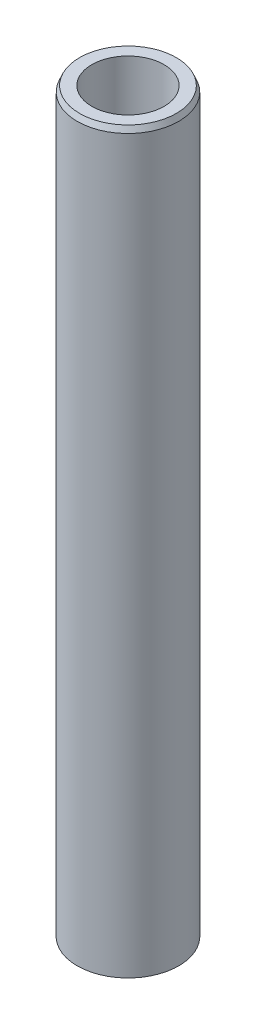
ISO-10303-21;
HEADER;
FILE_DESCRIPTION(('STEP AP214'),'2;1');
FILE_NAME('part.step','',(''),(''),'','','');
FILE_SCHEMA(('AUTOMOTIVE_DESIGN { 1 0 10303 214 1 1 1 1 }'));
ENDSEC;
DATA;
#1=APPLICATION_CONTEXT('core data for automotive mechanical design processes');
#2=APPLICATION_PROTOCOL_DEFINITION('international standard','automotive_design',2000,#1);
#3=PRODUCT_CONTEXT('',#1,'mechanical');
#4=PRODUCT('Part','Part','',(#3));
#5=PRODUCT_RELATED_PRODUCT_CATEGORY('part','',(#4));
#6=PRODUCT_DEFINITION_FORMATION('','',#4);
#7=PRODUCT_DEFINITION_CONTEXT('part definition',#1,'design');
#8=PRODUCT_DEFINITION('design','',#6,#7);
#9=PRODUCT_DEFINITION_SHAPE('','',#8);
#10=(LENGTH_UNIT() NAMED_UNIT(*) SI_UNIT(.MILLI.,.METRE.));
#11=(NAMED_UNIT(*) PLANE_ANGLE_UNIT() SI_UNIT($,.RADIAN.));
#12=(NAMED_UNIT(*) SI_UNIT($,.STERADIAN.) SOLID_ANGLE_UNIT());
#13=UNCERTAINTY_MEASURE_WITH_UNIT(LENGTH_MEASURE(1.E-05),#10,'distance_accuracy_value','');
#14=(GEOMETRIC_REPRESENTATION_CONTEXT(3) GLOBAL_UNCERTAINTY_ASSIGNED_CONTEXT((#13)) GLOBAL_UNIT_ASSIGNED_CONTEXT((#10,
#11,#12)) REPRESENTATION_CONTEXT('',''));
#15=CARTESIAN_POINT('',(0.,0.,0.));
#16=DIRECTION('',(0.,0.,1.));
#17=DIRECTION('',(1.,0.,0.));
#18=AXIS2_PLACEMENT_3D('',#15,#16,#17);
#19=CARTESIAN_POINT('',(0.,509.698656474132,0.));
#20=DIRECTION('',(0.,-1.,0.));
#21=DIRECTION('',(0.,0.,-1.));
#22=AXIS2_PLACEMENT_3D('',#19,#20,#21);
#23=CYLINDRICAL_SURFACE('',#22,35.);
#24=CARTESIAN_POINT('',(0.,505.778155098372,0.));
#25=DIRECTION('',(0.,1.,0.));
#26=DIRECTION('',(0.,0.,1.));
#27=AXIS2_PLACEMENT_3D('',#24,#25,#26);
#28=CIRCLE('',#27,35.);
#29=CARTESIAN_POINT('',(0.,505.778155098372,35.));
#30=VERTEX_POINT('',#29);
#31=EDGE_CURVE('E50',#30,#30,#28,.F.);
#32=ORIENTED_EDGE('',*,*,#31,.T.);
#33=EDGE_LOOP('',(#32));
#34=FACE_BOUND('',#33,.T.);
#35=CARTESIAN_POINT('',(0.,1.65531795123319,0.));
#36=DIRECTION('',(0.,1.,0.));
#37=DIRECTION('',(0.,0.,1.));
#38=AXIS2_PLACEMENT_3D('',#35,#36,#37);
#39=CIRCLE('',#38,35.);
#40=CARTESIAN_POINT('',(0.,1.65531795123319,35.));
#41=VERTEX_POINT('',#40);
#42=EDGE_CURVE('E51',#41,#41,#39,.T.);
#43=ORIENTED_EDGE('',*,*,#42,.T.);
#44=EDGE_LOOP('',(#43));
#45=FACE_BOUND('',#44,.T.);
#46=ADVANCED_FACE('F39',(#34,#45),#23,.T.);
#47=CARTESIAN_POINT('',(0.,509.698656474132,0.));
#48=DIRECTION('',(0.,1.,0.));
#49=DIRECTION('',(0.,0.,1.));
#50=AXIS2_PLACEMENT_3D('',#47,#48,#49);
#51=PLANE('',#50);
#52=CARTESIAN_POINT('',(0.,509.698656474132,0.));
#53=DIRECTION('',(0.,1.,0.));
#54=DIRECTION('',(0.,0.,1.));
#55=AXIS2_PLACEMENT_3D('',#52,#53,#54);
#56=CIRCLE('',#55,33.3446820487669);
#57=CARTESIAN_POINT('',(0.,509.698656474132,33.3446820487669));
#58=VERTEX_POINT('',#57);
#59=EDGE_CURVE('E54',#58,#58,#56,.T.);
#60=ORIENTED_EDGE('',*,*,#59,.T.);
#61=EDGE_LOOP('',(#60));
#62=FACE_BOUND('',#61,.T.);
#63=CARTESIAN_POINT('',(0.,509.698656474132,0.));
#64=DIRECTION('',(0.,1.,0.));
#65=DIRECTION('',(0.,0.,1.));
#66=AXIS2_PLACEMENT_3D('',#63,#64,#65);
#67=CIRCLE('',#66,24.9320092241053);
#68=CARTESIAN_POINT('',(0.,509.698656474132,24.9320092241053));
#69=VERTEX_POINT('',#68);
#70=EDGE_CURVE('E58',#69,#69,#67,.T.);
#71=ORIENTED_EDGE('',*,*,#70,.F.);
#72=EDGE_LOOP('',(#71));
#73=FACE_BOUND('',#72,.T.);
#74=ADVANCED_FACE('F69',(#62,#73),#51,.T.);
#75=CARTESIAN_POINT('',(0.,0.,0.));
#76=DIRECTION('',(0.,1.,0.));
#77=DIRECTION('',(0.,0.,1.));
#78=AXIS2_PLACEMENT_3D('',#75,#76,#77);
#79=PLANE('',#78);
#80=CARTESIAN_POINT('',(0.,0.,0.));
#81=DIRECTION('',(0.,1.,0.));
#82=DIRECTION('',(0.,0.,1.));
#83=AXIS2_PLACEMENT_3D('',#80,#81,#82);
#84=CIRCLE('',#83,31.079498624239);
#85=CARTESIAN_POINT('',(0.,0.,31.079498624239));
#86=VERTEX_POINT('',#85);
#87=EDGE_CURVE('E10',#86,#86,#84,.F.);
#88=ORIENTED_EDGE('',*,*,#87,.T.);
#89=EDGE_LOOP('',(#88));
#90=FACE_BOUND('',#89,.T.);
#91=CARTESIAN_POINT('',(0.,0.,0.));
#92=DIRECTION('',(0.,1.,0.));
#93=DIRECTION('',(0.,0.,1.));
#94=AXIS2_PLACEMENT_3D('',#91,#92,#93);
#95=CIRCLE('',#94,24.9320092241053);
#96=CARTESIAN_POINT('',(0.,0.,24.9320092241053));
#97=VERTEX_POINT('',#96);
#98=EDGE_CURVE('E63',#97,#97,#95,.T.);
#99=ORIENTED_EDGE('',*,*,#98,.T.);
#100=EDGE_LOOP('',(#99));
#101=FACE_BOUND('',#100,.T.);
#102=ADVANCED_FACE('F75',(#90,#101),#79,.F.);
#103=CARTESIAN_POINT('',(0.,509.698656474132,0.));
#104=DIRECTION('',(0.,-1.,0.));
#105=DIRECTION('',(0.,0.,-1.));
#106=AXIS2_PLACEMENT_3D('',#103,#104,#105);
#107=CYLINDRICAL_SURFACE('',#106,24.9320092241053);
#108=ORIENTED_EDGE('',*,*,#70,.T.);
#109=EDGE_LOOP('',(#108));
#110=FACE_BOUND('',#109,.T.);
#111=ORIENTED_EDGE('',*,*,#98,.F.);
#112=EDGE_LOOP('',(#111));
#113=FACE_BOUND('',#112,.T.);
#114=ADVANCED_FACE('F70',(#110,#113),#107,.F.);
#115=CARTESIAN_POINT('',(0.,509.698656474132,0.));
#116=DIRECTION('',(0.,-1.,0.));
#117=DIRECTION('',(0.,0.,-1.));
#118=AXIS2_PLACEMENT_3D('',#115,#116,#117);
#119=CONICAL_SURFACE('',#118,33.3446820487669,0.399514443678589);
#120=ORIENTED_EDGE('',*,*,#31,.F.);
#121=EDGE_LOOP('',(#120));
#122=FACE_BOUND('',#121,.T.);
#123=ORIENTED_EDGE('',*,*,#59,.F.);
#124=EDGE_LOOP('',(#123));
#125=FACE_BOUND('',#124,.T.);
#126=ADVANCED_FACE('F81',(#122,#125),#119,.T.);
#127=CARTESIAN_POINT('',(0.,1.65531795123319,0.));
#128=DIRECTION('',(0.,1.,0.));
#129=DIRECTION('',(0.,0.,1.));
#130=AXIS2_PLACEMENT_3D('',#127,#128,#129);
#131=CONICAL_SURFACE('',#130,35.,1.17128188311631);
#132=CARTESIAN_POINT('',(0.,0.,31.079498624239));
#133=CARTESIAN_POINT('',(0.,0.0172428953253456,31.1203371802365));
#134=CARTESIAN_POINT('',(0.,0.0344857906506913,31.161175736234));
#135=CARTESIAN_POINT('',(0.,0.0689715813013828,31.242852848229));
#136=CARTESIAN_POINT('',(0.,0.0862144766267285,31.2836914042265));
#137=CARTESIAN_POINT('',(0.,0.12070026727742,31.3653685162216));
#138=CARTESIAN_POINT('',(0.,0.137943162602766,31.4062070722191));
#139=CARTESIAN_POINT('',(0.,0.172428953253457,31.4878841842141));
#140=CARTESIAN_POINT('',(0.,0.189671848578803,31.5287227402116));
#141=CARTESIAN_POINT('',(0.,0.224157639229494,31.6103998522066));
#142=CARTESIAN_POINT('',(0.,0.241400534554841,31.6512384082041));
#143=CARTESIAN_POINT('',(0.,0.275886325205532,31.7329155201991));
#144=CARTESIAN_POINT('',(0.,0.293129220530878,31.7737540761967));
#145=CARTESIAN_POINT('',(0.,0.327615011181569,31.8554311881917));
#146=CARTESIAN_POINT('',(0.,0.344857906506915,31.8962697441892));
#147=CARTESIAN_POINT('',(0.,0.379343697157607,31.9779468561842));
#148=CARTESIAN_POINT('',(0.,0.396586592482952,32.0187854121817));
#149=CARTESIAN_POINT('',(0.,0.431072383133644,32.1004625241767));
#150=CARTESIAN_POINT('',(0.,0.448315278458989,32.1413010801743));
#151=CARTESIAN_POINT('',(0.,0.482801069109681,32.2229781921693));
#152=CARTESIAN_POINT('',(0.,0.500043964435027,32.2638167481668));
#153=CARTESIAN_POINT('',(0.,0.534529755085718,32.3454938601618));
#154=CARTESIAN_POINT('',(0.,0.551772650411064,32.3863324161593));
#155=CARTESIAN_POINT('',(0.,0.586258441061756,32.4680095281543));
#156=CARTESIAN_POINT('',(0.,0.603501336387101,32.5088480841519));
#157=CARTESIAN_POINT('',(0.,0.637987127037793,32.5905251961469));
#158=CARTESIAN_POINT('',(0.,0.655230022363139,32.6313637521444));
#159=CARTESIAN_POINT('',(0.,0.68971581301383,32.7130408641394));
#160=CARTESIAN_POINT('',(0.,0.706958708339176,32.7538794201369));
#161=CARTESIAN_POINT('',(0.,0.741444498989867,32.8355565321319));
#162=CARTESIAN_POINT('',(0.,0.758687394315213,32.8763950881294));
#163=CARTESIAN_POINT('',(0.,0.793173184965904,32.9580722001245));
#164=CARTESIAN_POINT('',(0.,0.810416080291251,32.998910756122));
#165=CARTESIAN_POINT('',(0.,0.844901870941942,33.080587868117));
#166=CARTESIAN_POINT('',(0.,0.862144766267288,33.1214264241145));
#167=CARTESIAN_POINT('',(0.,0.896630556917979,33.2031035361095));
#168=CARTESIAN_POINT('',(0.,0.913873452243325,33.243942092107));
#169=CARTESIAN_POINT('',(0.,0.948359242894017,33.3256192041021));
#170=CARTESIAN_POINT('',(0.,0.965602138219362,33.3664577600996));
#171=CARTESIAN_POINT('',(0.,1.00008792887005,33.4481348720946));
#172=CARTESIAN_POINT('',(0.,1.0173308241954,33.4889734280921));
#173=CARTESIAN_POINT('',(0.,1.05181661484609,33.5706505400871));
#174=CARTESIAN_POINT('',(0.,1.06905951017144,33.6114890960846));
#175=CARTESIAN_POINT('',(0.,1.10354530082213,33.6931662080797));
#176=CARTESIAN_POINT('',(0.,1.12078819614747,33.7340047640772));
#177=CARTESIAN_POINT('',(0.,1.15527398679817,33.8156818760722));
#178=CARTESIAN_POINT('',(0.,1.17251688212351,33.8565204320697));
#179=CARTESIAN_POINT('',(0.,1.2070026727742,33.9381975440647));
#180=CARTESIAN_POINT('',(0.,1.22424556809955,33.9790361000622));
#181=CARTESIAN_POINT('',(0.,1.25873135875024,34.0607132120573));
#182=CARTESIAN_POINT('',(0.,1.27597425407559,34.1015517680548));
#183=CARTESIAN_POINT('',(0.,1.31046004472628,34.1832288800498));
#184=CARTESIAN_POINT('',(0.,1.32770294005162,34.2240674360473));
#185=CARTESIAN_POINT('',(0.,1.36218873070231,34.3057445480423));
#186=CARTESIAN_POINT('',(0.,1.37943162602766,34.3465831040398));
#187=CARTESIAN_POINT('',(0.,1.41391741667835,34.4282602160349));
#188=CARTESIAN_POINT('',(0.,1.4311603120037,34.4690987720324));
#189=CARTESIAN_POINT('',(0.,1.46564610265439,34.5507758840274));
#190=CARTESIAN_POINT('',(0.,1.48288899797974,34.5916144400249));
#191=CARTESIAN_POINT('',(0.,1.51737478863043,34.6732915520199));
#192=CARTESIAN_POINT('',(0.,1.53461768395577,34.7141301080174));
#193=CARTESIAN_POINT('',(0.,1.56910347460646,34.7958072200125));
#194=CARTESIAN_POINT('',(0.,1.58634636993181,34.83664577601));
#195=CARTESIAN_POINT('',(0.,1.6208321605825,34.918322888005));
#196=CARTESIAN_POINT('',(0.,1.63807505590785,34.9591614440025));
#197=CARTESIAN_POINT('',(0.,1.65531795123319,35.));
#198=B_SPLINE_CURVE_WITH_KNOTS('',3,(#132,#133,#134,#135,#136,#137,#138,#139,#140,#141,#142,
#143,#144,#145,#146,#147,#148,#149,#150,#151,#152,#153,#154,#155,#156,#157,#158,#159,#160,#161,
#162,#163,#164,#165,#166,#167,#168,#169,#170,#171,#172,#173,#174,#175,#176,#177,#178,#179,#180,
#181,#182,#183,#184,#185,#186,#187,#188,#189,#190,#191,#192,#193,#194,#195,#196,#197),
.UNSPECIFIED.,.F.,.F.,(4,2,2,2,2,2,2,2,2,2,2,2,2,2,2,2,2,2,2,2,2,2,2,2,2,2,2,2,2,2,2,2,4),(0.,
0.132988517761738,0.265977035523475,0.398965553285213,0.531954071046951,0.664942588808682,
0.79793110657042,0.930919624332158,1.0639081420939,1.19689665985563,1.32988517761737,
1.46287369537911,1.59586221314085,1.72885073090258,1.86183924866432,1.99482776642606,
2.12781628418779,2.26080480194953,2.39379331971127,2.526781837473,2.65977035523474,
2.79275887299648,2.92574739075822,3.05873590851995,3.19172442628169,3.32471294404343,
3.45770146180517,3.5906899795669,3.72367849732864,3.85666701509037,3.98965553285211,
4.12264405061385,4.25563256837559),.UNSPECIFIED.);
#199=EDGE_CURVE('BSEAM45',#86,#41,#198,.T.);
#200=ORIENTED_EDGE('',*,*,#87,.F.);
#201=ORIENTED_EDGE('',*,*,#42,.F.);
#202=ORIENTED_EDGE('',*,*,#199,.T.);
#203=ORIENTED_EDGE('',*,*,#199,.F.);
#204=EDGE_LOOP('',(#200,#202,#201,#203));
#205=FACE_BOUND('',#204,.T.);
#206=ADVANCED_FACE('F45',(#205),#131,.T.);
#207=CLOSED_SHELL('',(#46,#74,#102,#114,#126,#206));
#208=MANIFOLD_SOLID_BREP('B2',#207);
#209=ADVANCED_BREP_SHAPE_REPRESENTATION('',(#18,#208),#14);
#210=SHAPE_DEFINITION_REPRESENTATION(#9,#209);
ENDSEC;
END-ISO-10303-21;
